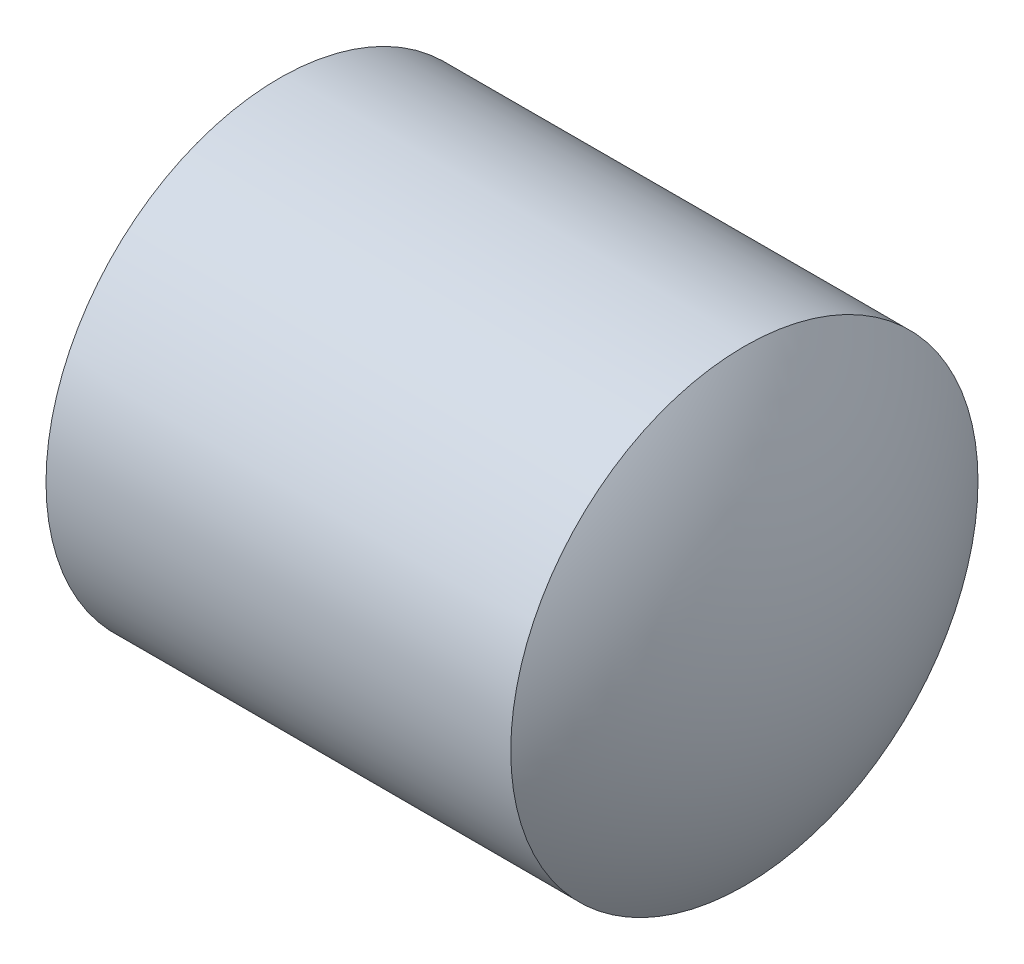
ISO-10303-21;
HEADER;
FILE_DESCRIPTION(('STEP AP214'),'2;1');
FILE_NAME('part.step','',(''),(''),'','','');
FILE_SCHEMA(('AUTOMOTIVE_DESIGN { 1 0 10303 214 1 1 1 1 }'));
ENDSEC;
DATA;
#1=APPLICATION_CONTEXT('core data for automotive mechanical design processes');
#2=APPLICATION_PROTOCOL_DEFINITION('international standard','automotive_design',2000,#1);
#3=PRODUCT_CONTEXT('',#1,'mechanical');
#4=PRODUCT('Part','Part','',(#3));
#5=PRODUCT_RELATED_PRODUCT_CATEGORY('part','',(#4));
#6=PRODUCT_DEFINITION_FORMATION('','',#4);
#7=PRODUCT_DEFINITION_CONTEXT('part definition',#1,'design');
#8=PRODUCT_DEFINITION('design','',#6,#7);
#9=PRODUCT_DEFINITION_SHAPE('','',#8);
#10=(LENGTH_UNIT() NAMED_UNIT(*) SI_UNIT(.MILLI.,.METRE.));
#11=(NAMED_UNIT(*) PLANE_ANGLE_UNIT() SI_UNIT($,.RADIAN.));
#12=(NAMED_UNIT(*) SI_UNIT($,.STERADIAN.) SOLID_ANGLE_UNIT());
#13=UNCERTAINTY_MEASURE_WITH_UNIT(LENGTH_MEASURE(1.E-05),#10,'distance_accuracy_value','');
#14=(GEOMETRIC_REPRESENTATION_CONTEXT(3) GLOBAL_UNCERTAINTY_ASSIGNED_CONTEXT((#13)) GLOBAL_UNIT_ASSIGNED_CONTEXT((#10,
#11,#12)) REPRESENTATION_CONTEXT('',''));
#15=CARTESIAN_POINT('',(0.,0.,0.));
#16=DIRECTION('',(0.,0.,1.));
#17=DIRECTION('',(1.,0.,0.));
#18=AXIS2_PLACEMENT_3D('',#15,#16,#17);
#19=CARTESIAN_POINT('',(74.3454492932875,0.,-130.));
#20=DIRECTION('',(-1.,0.,0.));
#21=DIRECTION('',(0.,0.,-1.));
#22=AXIS2_PLACEMENT_3D('',#19,#20,#21);
#23=SPHERICAL_SURFACE('',#22,227.085843867714);
#24=CARTESIAN_POINT('',(259.998700010775,0.,-130.));
#25=DIRECTION('',(-1.,0.,0.));
#26=DIRECTION('',(0.,0.,1.));
#27=AXIS2_PLACEMENT_3D('',#24,#25,#26);
#28=CIRCLE('',#27,130.770222081104);
#29=CARTESIAN_POINT('',(259.998700010775,0.,0.770222081104499));
#30=VERTEX_POINT('',#29);
#31=EDGE_CURVE('E54',#30,#30,#28,.T.);
#32=ORIENTED_EDGE('',*,*,#31,.F.);
#33=EDGE_LOOP('',(#32));
#34=FACE_BOUND('',#33,.T.);
#35=ADVANCED_FACE('F37',(#34),#23,.T.);
#36=CARTESIAN_POINT('',(74.3454492932875,0.,-130.));
#37=DIRECTION('',(-1.,0.,0.));
#38=DIRECTION('',(0.,0.,-1.));
#39=AXIS2_PLACEMENT_3D('',#36,#37,#38);
#40=SPHERICAL_SURFACE('',#39,226.085843867714);
#41=CARTESIAN_POINT('',(259.317903451673,0.,-130.));
#42=DIRECTION('',(-1.,0.,0.));
#43=DIRECTION('',(0.,0.,1.));
#44=AXIS2_PLACEMENT_3D('',#41,#42,#43);
#45=CIRCLE('',#44,130.);
#46=CARTESIAN_POINT('',(259.317903451673,0.,0.));
#47=VERTEX_POINT('',#46);
#48=EDGE_CURVE('E10',#47,#47,#45,.T.);
#49=ORIENTED_EDGE('',*,*,#48,.T.);
#50=EDGE_LOOP('',(#49));
#51=FACE_BOUND('',#50,.T.);
#52=ADVANCED_FACE('F64',(#51),#40,.F.);
#53=CARTESIAN_POINT('',(61.5048453889234,0.,-130.));
#54=DIRECTION('',(-1.,0.,0.));
#55=DIRECTION('',(0.,0.,1.));
#56=AXIS2_PLACEMENT_3D('',#53,#54,#55);
#57=CYLINDRICAL_SURFACE('',#56,130.);
#58=ORIENTED_EDGE('',*,*,#48,.F.);
#59=EDGE_LOOP('',(#58));
#60=FACE_BOUND('',#59,.T.);
#61=CARTESIAN_POINT('',(0.682096548326766,0.,-130.));
#62=DIRECTION('',(-1.,0.,0.));
#63=DIRECTION('',(0.,0.,1.));
#64=AXIS2_PLACEMENT_3D('',#61,#62,#63);
#65=CIRCLE('',#64,130.);
#66=CARTESIAN_POINT('',(0.682096548326766,0.,0.));
#67=VERTEX_POINT('',#66);
#68=EDGE_CURVE('E44',#67,#67,#65,.T.);
#69=ORIENTED_EDGE('',*,*,#68,.T.);
#70=EDGE_LOOP('',(#69));
#71=FACE_BOUND('',#70,.T.);
#72=ADVANCED_FACE('F68',(#60,#71),#57,.F.);
#73=CARTESIAN_POINT('',(-0.319470255708165,0.,-130.));
#74=DIRECTION('',(-1.,0.,0.));
#75=DIRECTION('',(0.,0.,1.));
#76=AXIS2_PLACEMENT_3D('',#73,#74,#75);
#77=CONICAL_SURFACE('',#76,130.598664702174,0.53874736946131);
#78=ORIENTED_EDGE('',*,*,#68,.F.);
#79=EDGE_LOOP('',(#78));
#80=FACE_BOUND('',#79,.T.);
#81=CARTESIAN_POINT('',(-0.319470255708165,0.,-130.));
#82=DIRECTION('',(-1.,0.,0.));
#83=DIRECTION('',(0.,0.,1.));
#84=AXIS2_PLACEMENT_3D('',#81,#82,#83);
#85=CIRCLE('',#84,130.598664702174);
#86=CARTESIAN_POINT('',(-0.319470255708165,0.,0.598664702173901));
#87=VERTEX_POINT('',#86);
#88=EDGE_CURVE('E49',#87,#87,#85,.T.);
#89=ORIENTED_EDGE('',*,*,#88,.T.);
#90=EDGE_LOOP('',(#89));
#91=FACE_BOUND('',#90,.T.);
#92=ADVANCED_FACE('F72',(#80,#91),#77,.F.);
#93=CARTESIAN_POINT('',(259.998700010775,0.,-130.));
#94=DIRECTION('',(1.,0.,0.));
#95=DIRECTION('',(0.,0.,-1.));
#96=AXIS2_PLACEMENT_3D('',#93,#94,#95);
#97=CONICAL_SURFACE('',#96,130.770222081104,0.000659029501928544);
#98=ORIENTED_EDGE('',*,*,#88,.F.);
#99=EDGE_LOOP('',(#98));
#100=FACE_BOUND('',#99,.T.);
#101=ORIENTED_EDGE('',*,*,#31,.T.);
#102=EDGE_LOOP('',(#101));
#103=FACE_BOUND('',#102,.T.);
#104=ADVANCED_FACE('F61',(#100,#103),#97,.T.);
#105=CLOSED_SHELL('',(#35,#52,#72,#92,#104));
#106=MANIFOLD_SOLID_BREP('B2',#105);
#107=ADVANCED_BREP_SHAPE_REPRESENTATION('',(#18,#106),#14);
#108=SHAPE_DEFINITION_REPRESENTATION(#9,#107);
ENDSEC;
END-ISO-10303-21;
